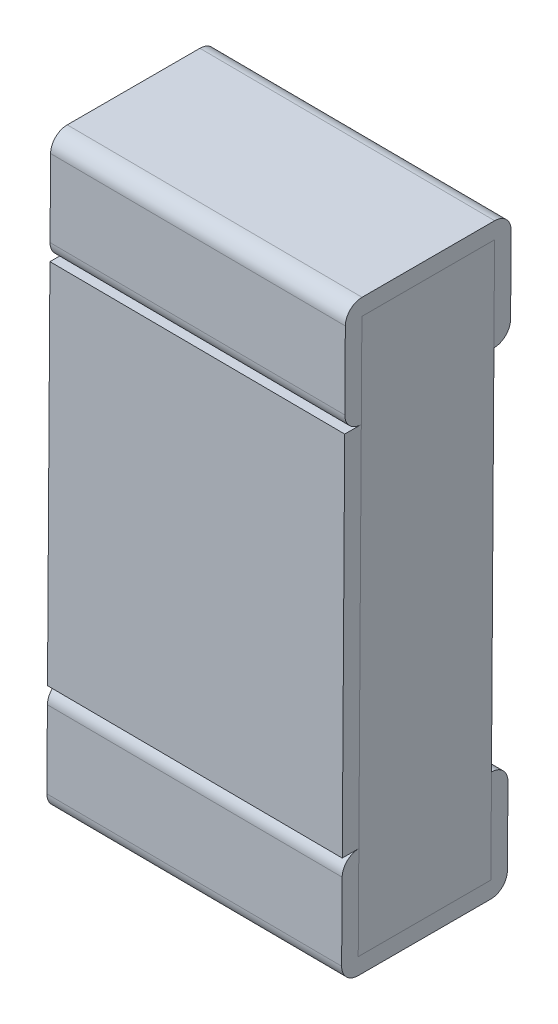
ISO-10303-21;
HEADER;
FILE_DESCRIPTION(('STEP AP214'),'2;1');
FILE_NAME('part.step','',(''),(''),'','','');
FILE_SCHEMA(('AUTOMOTIVE_DESIGN { 1 0 10303 214 1 1 1 1 }'));
ENDSEC;
DATA;
#1=APPLICATION_CONTEXT('core data for automotive mechanical design processes');
#2=APPLICATION_PROTOCOL_DEFINITION('international standard','automotive_design',2000,#1);
#3=PRODUCT_CONTEXT('',#1,'mechanical');
#4=PRODUCT('Part','Part','',(#3));
#5=PRODUCT_RELATED_PRODUCT_CATEGORY('part','',(#4));
#6=PRODUCT_DEFINITION_FORMATION('','',#4);
#7=PRODUCT_DEFINITION_CONTEXT('part definition',#1,'design');
#8=PRODUCT_DEFINITION('design','',#6,#7);
#9=PRODUCT_DEFINITION_SHAPE('','',#8);
#10=(LENGTH_UNIT() NAMED_UNIT(*) SI_UNIT(.MILLI.,.METRE.));
#11=(NAMED_UNIT(*) PLANE_ANGLE_UNIT() SI_UNIT($,.RADIAN.));
#12=(NAMED_UNIT(*) SI_UNIT($,.STERADIAN.) SOLID_ANGLE_UNIT());
#13=UNCERTAINTY_MEASURE_WITH_UNIT(LENGTH_MEASURE(1.E-05),#10,'distance_accuracy_value','');
#14=(GEOMETRIC_REPRESENTATION_CONTEXT(3) GLOBAL_UNCERTAINTY_ASSIGNED_CONTEXT((#13)) GLOBAL_UNIT_ASSIGNED_CONTEXT((#10,
#11,#12)) REPRESENTATION_CONTEXT('',''));
#15=CARTESIAN_POINT('',(0.,0.,0.));
#16=DIRECTION('',(0.,0.,1.));
#17=DIRECTION('',(1.,0.,0.));
#18=AXIS2_PLACEMENT_3D('',#15,#16,#17);
#19=CARTESIAN_POINT('',(191.579140246247,106.580336105174,142.661582908599));
#20=DIRECTION('',(0.,0.,1.));
#21=DIRECTION('',(1.,0.,0.));
#22=AXIS2_PLACEMENT_3D('',#19,#20,#21);
#23=PLANE('',#22);
#24=DIRECTION('',(0.999978016708569,-0.00663069374923689,0.));
#25=VECTOR('',#24,1.);
#26=CARTESIAN_POINT('',(191.579140246247,106.580336105174,142.661582908599));
#27=LINE('',#26,#25);
#28=CARTESIAN_POINT('',(191.579140246247,106.580336105174,142.661582908599));
#29=VERTEX_POINT('',#28);
#30=CARTESIAN_POINT('',(192.379122659614,106.575031550174,142.661582908599));
#31=VERTEX_POINT('',#30);
#32=EDGE_CURVE('E67',#29,#31,#27,.T.);
#33=ORIENTED_EDGE('',*,*,#32,.F.);
#34=DIRECTION('',(-0.00663069374923689,-0.999978016708569,0.));
#35=VECTOR('',#34,1.);
#36=CARTESIAN_POINT('',(191.579140246247,106.580336105174,142.661582908599));
#37=LINE('',#36,#35);
#38=CARTESIAN_POINT('',(191.572509552498,105.580358088465,142.661582908599));
#39=VERTEX_POINT('',#38);
#40=EDGE_CURVE('E11',#29,#39,#37,.T.);
#41=ORIENTED_EDGE('',*,*,#40,.T.);
#42=DIRECTION('',(0.999978016708569,-0.00663069374923689,0.));
#43=VECTOR('',#42,1.);
#44=CARTESIAN_POINT('',(191.572509552498,105.580358088465,142.661582908599));
#45=LINE('',#44,#43);
#46=CARTESIAN_POINT('',(192.372491965864,105.575053533466,142.661582908599));
#47=VERTEX_POINT('',#46);
#48=EDGE_CURVE('E55',#39,#47,#45,.T.);
#49=ORIENTED_EDGE('',*,*,#48,.T.);
#50=DIRECTION('',(-0.00663069374923689,-0.999978016708569,0.));
#51=VECTOR('',#50,1.);
#52=CARTESIAN_POINT('',(192.379122659614,106.575031550174,142.661582908599));
#53=LINE('',#52,#51);
#54=EDGE_CURVE('E188',#31,#47,#53,.T.);
#55=ORIENTED_EDGE('',*,*,#54,.F.);
#56=EDGE_LOOP('',(#33,#41,#49,#55));
#57=FACE_BOUND('',#56,.T.);
#58=ADVANCED_FACE('F44',(#57),#23,.T.);
#59=CARTESIAN_POINT('',(191.572509552498,105.580358088465,142.616582908599));
#60=DIRECTION('',(-0.00663069374923689,-0.99997801670857,0.));
#61=DIRECTION('',(-0.99997801670857,0.00663069374923689,0.));
#62=AXIS2_PLACEMENT_3D('',#59,#60,#61);
#63=PLANE('',#62);
#64=DIRECTION('',(0.,0.,1.));
#65=VECTOR('',#64,1.);
#66=CARTESIAN_POINT('',(191.572509552498,105.580358088465,142.616582908599));
#67=LINE('',#66,#65);
#68=CARTESIAN_POINT('',(191.572509552498,105.580358088465,142.616582908599));
#69=VERTEX_POINT('',#68);
#70=EDGE_CURVE('E834',#69,#39,#67,.T.);
#71=ORIENTED_EDGE('',*,*,#70,.F.);
#72=DIRECTION('',(0.999978016708569,-0.00663069374923689,0.));
#73=VECTOR('',#72,1.);
#74=CARTESIAN_POINT('',(191.572509552498,105.580358088465,142.616582908599));
#75=LINE('',#74,#73);
#76=CARTESIAN_POINT('',(192.372491965864,105.575053533466,142.616582908599));
#77=VERTEX_POINT('',#76);
#78=EDGE_CURVE('E204',#69,#77,#75,.T.);
#79=ORIENTED_EDGE('',*,*,#78,.T.);
#80=DIRECTION('',(0.,0.,1.));
#81=VECTOR('',#80,1.);
#82=CARTESIAN_POINT('',(192.372491965864,105.575053533466,142.616582908599));
#83=LINE('',#82,#81);
#84=EDGE_CURVE('E193',#77,#47,#83,.T.);
#85=ORIENTED_EDGE('',*,*,#84,.T.);
#86=ORIENTED_EDGE('',*,*,#48,.F.);
#87=EDGE_LOOP('',(#71,#79,#85,#86));
#88=FACE_BOUND('',#87,.T.);
#89=ADVANCED_FACE('F206',(#88),#63,.T.);
#90=CARTESIAN_POINT('',(191.572211171279,105.535359077713,142.616582908599));
#91=DIRECTION('',(0.999978016708571,-0.00663069374900344,0.));
#92=DIRECTION('',(0.00663069374900344,0.999978016708571,0.));
#93=AXIS2_PLACEMENT_3D('',#90,#91,#92);
#94=CYLINDRICAL_SURFACE('',#93,0.0450000000000037);
#95=CARTESIAN_POINT('',(191.572211171279,105.535359077713,142.616582908599));
#96=DIRECTION('',(0.99997801670857,-0.00663069374923689,0.));
#97=DIRECTION('',(0.,0.,1.));
#98=AXIS2_PLACEMENT_3D('',#95,#96,#97);
#99=CIRCLE('',#98,0.0449999999999895);
#100=CARTESIAN_POINT('',(191.572211171279,105.535359077713,142.661582908599));
#101=VERTEX_POINT('',#100);
#102=EDGE_CURVE('E210',#69,#101,#99,.T.);
#103=ORIENTED_EDGE('',*,*,#102,.T.);
#104=DIRECTION('',(0.999978016708569,-0.00663069374923689,0.));
#105=VECTOR('',#104,1.);
#106=CARTESIAN_POINT('',(191.572211171279,105.535359077713,142.661582908599));
#107=LINE('',#106,#105);
#108=CARTESIAN_POINT('',(192.372193584646,105.530054522714,142.661582908599));
#109=VERTEX_POINT('',#108);
#110=EDGE_CURVE('E219',#101,#109,#107,.T.);
#111=ORIENTED_EDGE('',*,*,#110,.T.);
#112=CARTESIAN_POINT('',(192.372193584646,105.530054522714,142.616582908599));
#113=DIRECTION('',(0.99997801670857,-0.00663069374923689,0.));
#114=DIRECTION('',(0.,0.,1.));
#115=AXIS2_PLACEMENT_3D('',#112,#113,#114);
#116=CIRCLE('',#115,0.0449999999999895);
#117=EDGE_CURVE('E332',#77,#109,#116,.T.);
#118=ORIENTED_EDGE('',*,*,#117,.F.);
#119=ORIENTED_EDGE('',*,*,#78,.F.);
#120=EDGE_LOOP('',(#103,#111,#118,#119));
#121=FACE_BOUND('',#120,.T.);
#122=ADVANCED_FACE('F398',(#121),#94,.T.);
#123=CARTESIAN_POINT('',(191.572509552498,105.580358088465,142.661582908599));
#124=DIRECTION('',(0.,0.,1.));
#125=DIRECTION('',(1.,0.,0.));
#126=AXIS2_PLACEMENT_3D('',#123,#124,#125);
#127=PLANE('',#126);
#128=DIRECTION('',(-0.00663069374923689,-0.999978016708569,0.));
#129=VECTOR('',#128,1.);
#130=CARTESIAN_POINT('',(192.372491965864,105.575053533466,142.661582908599));
#131=LINE('',#130,#129);
#132=CARTESIAN_POINT('',(192.370801138958,105.320059139205,142.661582908599));
#133=VERTEX_POINT('',#132);
#134=EDGE_CURVE('E249',#109,#133,#131,.T.);
#135=ORIENTED_EDGE('',*,*,#134,.F.);
#136=ORIENTED_EDGE('',*,*,#110,.F.);
#137=DIRECTION('',(-0.00663069374923689,-0.999978016708569,0.));
#138=VECTOR('',#137,1.);
#139=CARTESIAN_POINT('',(191.572509552498,105.580358088465,142.661582908599));
#140=LINE('',#139,#138);
#141=CARTESIAN_POINT('',(191.570818725591,105.325363694204,142.661582908599));
#142=VERTEX_POINT('',#141);
#143=EDGE_CURVE('E232',#101,#142,#140,.T.);
#144=ORIENTED_EDGE('',*,*,#143,.T.);
#145=DIRECTION('',(0.999978016708569,-0.00663069374923689,0.));
#146=VECTOR('',#145,1.);
#147=CARTESIAN_POINT('',(191.570818725591,105.325363694204,142.661582908599));
#148=LINE('',#147,#146);
#149=EDGE_CURVE('E284',#142,#133,#148,.T.);
#150=ORIENTED_EDGE('',*,*,#149,.T.);
#151=EDGE_LOOP('',(#135,#136,#144,#150));
#152=FACE_BOUND('',#151,.T.);
#153=ADVANCED_FACE('F402',(#152),#127,.T.);
#154=CARTESIAN_POINT('',(191.570818725591,105.325363694204,142.616582908599));
#155=DIRECTION('',(0.999978016708571,-0.00663069374900344,0.));
#156=DIRECTION('',(-0.00663069374900344,-0.999978016708571,0.));
#157=AXIS2_PLACEMENT_3D('',#154,#155,#156);
#158=CYLINDRICAL_SURFACE('',#157,0.0450000000000037);
#159=DIRECTION('',(0.999978016708569,-0.00663069374923689,0.));
#160=VECTOR('',#159,1.);
#161=CARTESIAN_POINT('',(191.570520344372,105.280364683453,142.616582908599));
#162=LINE('',#161,#160);
#163=CARTESIAN_POINT('',(191.570520344372,105.280364683453,142.616582908599));
#164=VERTEX_POINT('',#163);
#165=CARTESIAN_POINT('',(192.37050275774,105.275060128453,142.616582908599));
#166=VERTEX_POINT('',#165);
#167=EDGE_CURVE('E288',#164,#166,#162,.T.);
#168=ORIENTED_EDGE('',*,*,#167,.T.);
#169=CARTESIAN_POINT('',(192.370801138958,105.320059139205,142.616582908599));
#170=DIRECTION('',(-0.99997801670857,0.00663069374923689,0.));
#171=DIRECTION('',(0.,0.,1.));
#172=AXIS2_PLACEMENT_3D('',#169,#170,#171);
#173=CIRCLE('',#172,0.0449999999999895);
#174=EDGE_CURVE('E730',#166,#133,#173,.T.);
#175=ORIENTED_EDGE('',*,*,#174,.T.);
#176=ORIENTED_EDGE('',*,*,#149,.F.);
#177=CARTESIAN_POINT('',(191.570818725591,105.325363694204,142.616582908599));
#178=DIRECTION('',(-0.99997801670857,0.00663069374923689,0.));
#179=DIRECTION('',(0.,0.,1.));
#180=AXIS2_PLACEMENT_3D('',#177,#178,#179);
#181=CIRCLE('',#180,0.0449999999999895);
#182=EDGE_CURVE('E238',#164,#142,#181,.T.);
#183=ORIENTED_EDGE('',*,*,#182,.F.);
#184=EDGE_LOOP('',(#168,#175,#176,#183));
#185=FACE_BOUND('',#184,.T.);
#186=ADVANCED_FACE('F440',(#185),#158,.T.);
#187=CARTESIAN_POINT('',(191.570520344372,105.280364683453,142.211582908599));
#188=DIRECTION('',(-0.00663069374923689,-0.99997801670857,0.));
#189=DIRECTION('',(-0.99997801670857,0.00663069374923689,0.));
#190=AXIS2_PLACEMENT_3D('',#187,#188,#189);
#191=PLANE('',#190);
#192=DIRECTION('',(0.,0.,1.));
#193=VECTOR('',#192,1.);
#194=CARTESIAN_POINT('',(191.570520344372,105.280364683453,142.211582908599));
#195=LINE('',#194,#193);
#196=CARTESIAN_POINT('',(191.570520344372,105.280364683453,142.256582908599));
#197=VERTEX_POINT('',#196);
#198=EDGE_CURVE('E233',#197,#164,#195,.T.);
#199=ORIENTED_EDGE('',*,*,#198,.F.);
#200=DIRECTION('',(0.999978016708569,-0.00663069374923689,0.));
#201=VECTOR('',#200,1.);
#202=CARTESIAN_POINT('',(191.570520344372,105.280364683453,142.256582908599));
#203=LINE('',#202,#201);
#204=CARTESIAN_POINT('',(192.37050275774,105.275060128453,142.256582908599));
#205=VERTEX_POINT('',#204);
#206=EDGE_CURVE('E299',#197,#205,#203,.T.);
#207=ORIENTED_EDGE('',*,*,#206,.T.);
#208=DIRECTION('',(0.,0.,1.));
#209=VECTOR('',#208,1.);
#210=CARTESIAN_POINT('',(192.37050275774,105.275060128453,142.211582908599));
#211=LINE('',#210,#209);
#212=EDGE_CURVE('E295',#205,#166,#211,.T.);
#213=ORIENTED_EDGE('',*,*,#212,.T.);
#214=ORIENTED_EDGE('',*,*,#167,.F.);
#215=EDGE_LOOP('',(#199,#207,#213,#214));
#216=FACE_BOUND('',#215,.T.);
#217=ADVANCED_FACE('F564',(#216),#191,.T.);
#218=CARTESIAN_POINT('',(191.570818725591,105.325363694204,142.256582908599));
#219=DIRECTION('',(0.999978016708571,-0.00663069374900344,0.));
#220=DIRECTION('',(-0.00663069374900344,-0.999978016708571,0.));
#221=AXIS2_PLACEMENT_3D('',#218,#219,#220);
#222=CYLINDRICAL_SURFACE('',#221,0.0450000000000037);
#223=CARTESIAN_POINT('',(191.570818725591,105.325363694204,142.256582908599));
#224=DIRECTION('',(0.99997801670857,-0.00663069374923689,0.));
#225=DIRECTION('',(0.,0.,1.));
#226=AXIS2_PLACEMENT_3D('',#223,#224,#225);
#227=CIRCLE('',#226,0.0449999999999895);
#228=CARTESIAN_POINT('',(191.570818725591,105.325363694204,142.211582908599));
#229=VERTEX_POINT('',#228);
#230=EDGE_CURVE('E282',#197,#229,#227,.T.);
#231=ORIENTED_EDGE('',*,*,#230,.T.);
#232=DIRECTION('',(0.999978016708569,-0.00663069374923689,0.));
#233=VECTOR('',#232,1.);
#234=CARTESIAN_POINT('',(191.570818725591,105.325363694204,142.211582908599));
#235=LINE('',#234,#233);
#236=CARTESIAN_POINT('',(192.370801138958,105.320059139205,142.211582908599));
#237=VERTEX_POINT('',#236);
#238=EDGE_CURVE('E279',#229,#237,#235,.T.);
#239=ORIENTED_EDGE('',*,*,#238,.T.);
#240=CARTESIAN_POINT('',(192.370801138958,105.320059139205,142.256582908599));
#241=DIRECTION('',(0.99997801670857,-0.00663069374923689,0.));
#242=DIRECTION('',(0.,0.,1.));
#243=AXIS2_PLACEMENT_3D('',#240,#241,#242);
#244=CIRCLE('',#243,0.0449999999999895);
#245=EDGE_CURVE('E245',#205,#237,#244,.T.);
#246=ORIENTED_EDGE('',*,*,#245,.F.);
#247=ORIENTED_EDGE('',*,*,#206,.F.);
#248=EDGE_LOOP('',(#231,#239,#246,#247));
#249=FACE_BOUND('',#248,.T.);
#250=ADVANCED_FACE('F485',(#249),#222,.T.);
#251=CARTESIAN_POINT('',(191.572509552498,105.580358088465,142.211582908599));
#252=DIRECTION('',(0.,0.,1.));
#253=DIRECTION('',(1.,0.,0.));
#254=AXIS2_PLACEMENT_3D('',#251,#252,#253);
#255=PLANE('',#254);
#256=ORIENTED_EDGE('',*,*,#238,.F.);
#257=DIRECTION('',(-0.00663069374923689,-0.999978016708569,0.));
#258=VECTOR('',#257,1.);
#259=CARTESIAN_POINT('',(191.572509552498,105.580358088465,142.211582908599));
#260=LINE('',#259,#258);
#261=CARTESIAN_POINT('',(191.572211171279,105.535359077713,142.211582908599));
#262=VERTEX_POINT('',#261);
#263=EDGE_CURVE('E320',#262,#229,#260,.T.);
#264=ORIENTED_EDGE('',*,*,#263,.F.);
#265=DIRECTION('',(0.999978016708569,-0.00663069374923689,0.));
#266=VECTOR('',#265,1.);
#267=CARTESIAN_POINT('',(191.572211171279,105.535359077713,142.211582908599));
#268=LINE('',#267,#266);
#269=CARTESIAN_POINT('',(192.372193584646,105.530054522714,142.211582908599));
#270=VERTEX_POINT('',#269);
#271=EDGE_CURVE('E268',#262,#270,#268,.T.);
#272=ORIENTED_EDGE('',*,*,#271,.T.);
#273=DIRECTION('',(-0.00663069374923689,-0.999978016708569,0.));
#274=VECTOR('',#273,1.);
#275=CARTESIAN_POINT('',(192.372491965864,105.575053533466,142.211582908599));
#276=LINE('',#275,#274);
#277=EDGE_CURVE('E264',#270,#237,#276,.T.);
#278=ORIENTED_EDGE('',*,*,#277,.T.);
#279=EDGE_LOOP('',(#256,#264,#272,#278));
#280=FACE_BOUND('',#279,.T.);
#281=ADVANCED_FACE('F362',(#280),#255,.F.);
#282=CARTESIAN_POINT('',(191.572211171279,105.535359077713,142.256582908599));
#283=DIRECTION('',(0.999978016708571,-0.00663069374900344,0.));
#284=DIRECTION('',(0.00663069374900344,0.999978016708571,0.));
#285=AXIS2_PLACEMENT_3D('',#282,#283,#284);
#286=CYLINDRICAL_SURFACE('',#285,0.0450000000000037);
#287=DIRECTION('',(0.999978016708569,-0.00663069374923689,0.));
#288=VECTOR('',#287,1.);
#289=CARTESIAN_POINT('',(191.572509552498,105.580358088465,142.256582908599));
#290=LINE('',#289,#288);
#291=CARTESIAN_POINT('',(191.572509552498,105.580358088465,142.256582908599));
#292=VERTEX_POINT('',#291);
#293=CARTESIAN_POINT('',(192.372491965864,105.575053533466,142.256582908599));
#294=VERTEX_POINT('',#293);
#295=EDGE_CURVE('E258',#292,#294,#290,.T.);
#296=ORIENTED_EDGE('',*,*,#295,.T.);
#297=CARTESIAN_POINT('',(192.372193584646,105.530054522714,142.256582908599));
#298=DIRECTION('',(-0.99997801670857,0.00663069374923689,0.));
#299=DIRECTION('',(0.,0.,1.));
#300=AXIS2_PLACEMENT_3D('',#297,#298,#299);
#301=CIRCLE('',#300,0.0449999999999895);
#302=EDGE_CURVE('E254',#294,#270,#301,.T.);
#303=ORIENTED_EDGE('',*,*,#302,.T.);
#304=ORIENTED_EDGE('',*,*,#271,.F.);
#305=CARTESIAN_POINT('',(191.572211171279,105.535359077713,142.256582908599));
#306=DIRECTION('',(-0.99997801670857,0.00663069374923689,0.));
#307=DIRECTION('',(0.,0.,1.));
#308=AXIS2_PLACEMENT_3D('',#305,#306,#307);
#309=CIRCLE('',#308,0.0449999999999895);
#310=EDGE_CURVE('E315',#292,#262,#309,.T.);
#311=ORIENTED_EDGE('',*,*,#310,.F.);
#312=EDGE_LOOP('',(#296,#303,#304,#311));
#313=FACE_BOUND('',#312,.T.);
#314=ADVANCED_FACE('F356',(#313),#286,.T.);
#315=CARTESIAN_POINT('',(192.379122659614,106.575031550174,142.616582908599));
#316=DIRECTION('',(0.99997801670857,-0.00663069374923689,0.));
#317=DIRECTION('',(0.,0.,-1.));
#318=AXIS2_PLACEMENT_3D('',#315,#316,#317);
#319=PLANE('',#318);
#320=DIRECTION('',(-0.00663069374923689,-0.999978016708569,0.));
#321=VECTOR('',#320,1.);
#322=CARTESIAN_POINT('',(192.379122659614,106.575031550174,142.616582908599));
#323=LINE('',#322,#321);
#324=CARTESIAN_POINT('',(192.379122659614,106.575031550174,142.616582908599));
#325=VERTEX_POINT('',#324);
#326=EDGE_CURVE('E308',#325,#77,#323,.T.);
#327=ORIENTED_EDGE('',*,*,#326,.F.);
#328=DIRECTION('',(0.,0.,1.));
#329=VECTOR('',#328,1.);
#330=CARTESIAN_POINT('',(192.379122659614,106.575031550174,142.616582908599));
#331=LINE('',#330,#329);
#332=EDGE_CURVE('E196',#325,#31,#331,.T.);
#333=ORIENTED_EDGE('',*,*,#332,.T.);
#334=ORIENTED_EDGE('',*,*,#54,.T.);
#335=ORIENTED_EDGE('',*,*,#84,.F.);
#336=EDGE_LOOP('',(#327,#333,#334,#335));
#337=FACE_BOUND('',#336,.T.);
#338=ADVANCED_FACE('F191',(#337),#319,.T.);
#339=CARTESIAN_POINT('',(192.372491965864,105.575053533466,142.211582908599));
#340=DIRECTION('',(0.99997801670857,-0.00663069374923689,0.));
#341=DIRECTION('',(0.,0.,-1.));
#342=AXIS2_PLACEMENT_3D('',#339,#340,#341);
#343=PLANE('',#342);
#344=ORIENTED_EDGE('',*,*,#277,.F.);
#345=ORIENTED_EDGE('',*,*,#302,.F.);
#346=DIRECTION('',(-0.00663069374923689,-0.999978016708569,0.));
#347=VECTOR('',#346,1.);
#348=CARTESIAN_POINT('',(192.38081348652,106.830025944435,142.256582908599));
#349=LINE('',#348,#347);
#350=CARTESIAN_POINT('',(192.370801138958,105.320059139205,142.256582908599));
#351=VERTEX_POINT('',#350);
#352=EDGE_CURVE('E198',#294,#351,#349,.T.);
#353=ORIENTED_EDGE('',*,*,#352,.T.);
#354=DIRECTION('',(0.,0.,1.));
#355=VECTOR('',#354,1.);
#356=CARTESIAN_POINT('',(192.370801138958,105.320059139205,142.256582908599));
#357=LINE('',#356,#355);
#358=CARTESIAN_POINT('',(192.370801138958,105.320059139205,142.616582908599));
#359=VERTEX_POINT('',#358);
#360=EDGE_CURVE('E335',#351,#359,#357,.T.);
#361=ORIENTED_EDGE('',*,*,#360,.T.);
#362=DIRECTION('',(-0.00663069374923689,-0.999978016708569,0.));
#363=VECTOR('',#362,1.);
#364=CARTESIAN_POINT('',(192.38081348652,106.830025944435,142.616582908599));
#365=LINE('',#364,#363);
#366=EDGE_CURVE('E331',#77,#359,#365,.T.);
#367=ORIENTED_EDGE('',*,*,#366,.F.);
#368=ORIENTED_EDGE('',*,*,#117,.T.);
#369=ORIENTED_EDGE('',*,*,#134,.T.);
#370=ORIENTED_EDGE('',*,*,#174,.F.);
#371=ORIENTED_EDGE('',*,*,#212,.F.);
#372=ORIENTED_EDGE('',*,*,#245,.T.);
#373=EDGE_LOOP('',(#344,#345,#353,#361,#367,#368,#369,#370,#371,#372));
#374=FACE_BOUND('',#373,.T.);
#375=ADVANCED_FACE('F385',(#374),#343,.T.);
#376=CARTESIAN_POINT('',(191.579140246247,106.580336105174,142.616582908599));
#377=DIRECTION('',(-0.00663069374923689,-0.99997801670857,0.));
#378=DIRECTION('',(-0.99997801670857,0.00663069374923689,0.));
#379=AXIS2_PLACEMENT_3D('',#376,#377,#378);
#380=PLANE('',#379);
#381=ORIENTED_EDGE('',*,*,#32,.T.);
#382=ORIENTED_EDGE('',*,*,#332,.F.);
#383=DIRECTION('',(0.999978016708569,-0.00663069374923689,0.));
#384=VECTOR('',#383,1.);
#385=CARTESIAN_POINT('',(191.579140246247,106.580336105174,142.616582908599));
#386=LINE('',#385,#384);
#387=CARTESIAN_POINT('',(191.579140246247,106.580336105174,142.616582908599));
#388=VERTEX_POINT('',#387);
#389=EDGE_CURVE('E313',#388,#325,#386,.T.);
#390=ORIENTED_EDGE('',*,*,#389,.F.);
#391=DIRECTION('',(0.,0.,1.));
#392=VECTOR('',#391,1.);
#393=CARTESIAN_POINT('',(191.579140246247,106.580336105174,142.616582908599));
#394=LINE('',#393,#392);
#395=EDGE_CURVE('E322',#388,#29,#394,.T.);
#396=ORIENTED_EDGE('',*,*,#395,.T.);
#397=EDGE_LOOP('',(#381,#382,#390,#396));
#398=FACE_BOUND('',#397,.T.);
#399=ADVANCED_FACE('F389',(#398),#380,.F.);
#400=CARTESIAN_POINT('',(191.579140246247,106.580336105174,142.616582908599));
#401=DIRECTION('',(0.99997801670857,-0.00663069374923689,0.));
#402=DIRECTION('',(0.,0.,-1.));
#403=AXIS2_PLACEMENT_3D('',#400,#401,#402);
#404=PLANE('',#403);
#405=ORIENTED_EDGE('',*,*,#70,.T.);
#406=ORIENTED_EDGE('',*,*,#40,.F.);
#407=ORIENTED_EDGE('',*,*,#395,.F.);
#408=DIRECTION('',(-0.00663069374923689,-0.999978016708569,0.));
#409=VECTOR('',#408,1.);
#410=CARTESIAN_POINT('',(191.579140246247,106.580336105174,142.616582908599));
#411=LINE('',#410,#409);
#412=EDGE_CURVE('E237',#388,#69,#411,.T.);
#413=ORIENTED_EDGE('',*,*,#412,.T.);
#414=EDGE_LOOP('',(#405,#406,#407,#413));
#415=FACE_BOUND('',#414,.T.);
#416=ADVANCED_FACE('F425',(#415),#404,.F.);
#417=CARTESIAN_POINT('',(191.572509552498,105.580358088465,142.211582908599));
#418=DIRECTION('',(0.99997801670857,-0.00663069374923689,0.));
#419=DIRECTION('',(0.,0.,-1.));
#420=AXIS2_PLACEMENT_3D('',#417,#418,#419);
#421=PLANE('',#420);
#422=ORIENTED_EDGE('',*,*,#230,.F.);
#423=ORIENTED_EDGE('',*,*,#198,.T.);
#424=ORIENTED_EDGE('',*,*,#182,.T.);
#425=ORIENTED_EDGE('',*,*,#143,.F.);
#426=ORIENTED_EDGE('',*,*,#102,.F.);
#427=DIRECTION('',(-0.00663069374923689,-0.999978016708569,0.));
#428=VECTOR('',#427,1.);
#429=CARTESIAN_POINT('',(191.580831073153,106.835330499434,142.616582908599));
#430=LINE('',#429,#428);
#431=CARTESIAN_POINT('',(191.570818725591,105.325363694204,142.616582908599));
#432=VERTEX_POINT('',#431);
#433=EDGE_CURVE('E319',#69,#432,#430,.T.);
#434=ORIENTED_EDGE('',*,*,#433,.T.);
#435=DIRECTION('',(0.,0.,1.));
#436=VECTOR('',#435,1.);
#437=CARTESIAN_POINT('',(191.570818725591,105.325363694204,142.256582908599));
#438=LINE('',#437,#436);
#439=CARTESIAN_POINT('',(191.570818725591,105.325363694204,142.256582908599));
#440=VERTEX_POINT('',#439);
#441=EDGE_CURVE('E225',#440,#432,#438,.T.);
#442=ORIENTED_EDGE('',*,*,#441,.F.);
#443=DIRECTION('',(-0.00663069374923689,-0.999978016708569,0.));
#444=VECTOR('',#443,1.);
#445=CARTESIAN_POINT('',(191.580831073153,106.835330499434,142.256582908599));
#446=LINE('',#445,#444);
#447=EDGE_CURVE('E48',#292,#440,#446,.T.);
#448=ORIENTED_EDGE('',*,*,#447,.F.);
#449=ORIENTED_EDGE('',*,*,#310,.T.);
#450=ORIENTED_EDGE('',*,*,#263,.T.);
#451=EDGE_LOOP('',(#422,#423,#424,#425,#426,#434,#442,#448,#449,#450));
#452=FACE_BOUND('',#451,.T.);
#453=ADVANCED_FACE('F46',(#452),#421,.F.);
#454=CARTESIAN_POINT('',(191.580831073153,106.835330499434,142.256582908599));
#455=DIRECTION('',(0.,0.,1.));
#456=DIRECTION('',(1.,0.,0.));
#457=AXIS2_PLACEMENT_3D('',#454,#455,#456);
#458=PLANE('',#457);
#459=DIRECTION('',(-0.00663069374923689,-0.999978016708569,0.));
#460=VECTOR('',#459,1.);
#461=CARTESIAN_POINT('',(192.38081348652,106.830025944435,142.256582908599));
#462=LINE('',#461,#460);
#463=CARTESIAN_POINT('',(192.379122659614,106.575031550174,142.256582908599));
#464=VERTEX_POINT('',#463);
#465=EDGE_CURVE('E223',#464,#294,#462,.T.);
#466=ORIENTED_EDGE('',*,*,#465,.T.);
#467=ORIENTED_EDGE('',*,*,#295,.F.);
#468=DIRECTION('',(-0.00663069374923689,-0.999978016708569,0.));
#469=VECTOR('',#468,1.);
#470=CARTESIAN_POINT('',(191.580831073153,106.835330499434,142.256582908599));
#471=LINE('',#470,#469);
#472=CARTESIAN_POINT('',(191.579140246247,106.580336105174,142.256582908599));
#473=VERTEX_POINT('',#472);
#474=EDGE_CURVE('E355',#473,#292,#471,.T.);
#475=ORIENTED_EDGE('',*,*,#474,.F.);
#476=DIRECTION('',(0.999978016708569,-0.00663069374923689,0.));
#477=VECTOR('',#476,1.);
#478=CARTESIAN_POINT('',(191.579140246247,106.580336105174,142.256582908599));
#479=LINE('',#478,#477);
#480=EDGE_CURVE('E269',#473,#464,#479,.T.);
#481=ORIENTED_EDGE('',*,*,#480,.T.);
#482=EDGE_LOOP('',(#466,#467,#475,#481));
#483=FACE_BOUND('',#482,.T.);
#484=ADVANCED_FACE('F499',(#483),#458,.F.);
#485=CARTESIAN_POINT('',(192.38081348652,106.830025944435,142.256582908599));
#486=DIRECTION('',(0.99997801670857,-0.00663069374923689,0.));
#487=DIRECTION('',(0.,0.,-1.));
#488=AXIS2_PLACEMENT_3D('',#485,#486,#487);
#489=PLANE('',#488);
#490=DIRECTION('',(-0.00663069374923689,-0.999978016708569,0.));
#491=VECTOR('',#490,1.);
#492=CARTESIAN_POINT('',(192.38081348652,106.830025944435,142.256582908599));
#493=LINE('',#492,#491);
#494=CARTESIAN_POINT('',(192.38081348652,106.830025944435,142.256582908599));
#495=VERTEX_POINT('',#494);
#496=EDGE_CURVE('E345',#495,#464,#493,.T.);
#497=ORIENTED_EDGE('',*,*,#496,.F.);
#498=DIRECTION('',(0.,0.,1.));
#499=VECTOR('',#498,1.);
#500=CARTESIAN_POINT('',(192.38081348652,106.830025944435,142.256582908599));
#501=LINE('',#500,#499);
#502=CARTESIAN_POINT('',(192.38081348652,106.830025944435,142.616582908599));
#503=VERTEX_POINT('',#502);
#504=EDGE_CURVE('E273',#495,#503,#501,.T.);
#505=ORIENTED_EDGE('',*,*,#504,.T.);
#506=DIRECTION('',(-0.00663069374923689,-0.999978016708569,0.));
#507=VECTOR('',#506,1.);
#508=CARTESIAN_POINT('',(192.38081348652,106.830025944435,142.616582908599));
#509=LINE('',#508,#507);
#510=EDGE_CURVE('E304',#503,#325,#509,.T.);
#511=ORIENTED_EDGE('',*,*,#510,.T.);
#512=ORIENTED_EDGE('',*,*,#326,.T.);
#513=ORIENTED_EDGE('',*,*,#366,.T.);
#514=ORIENTED_EDGE('',*,*,#360,.F.);
#515=ORIENTED_EDGE('',*,*,#352,.F.);
#516=ORIENTED_EDGE('',*,*,#465,.F.);
#517=EDGE_LOOP('',(#497,#505,#511,#512,#513,#514,#515,#516));
#518=FACE_BOUND('',#517,.T.);
#519=ADVANCED_FACE('F494',(#518),#489,.T.);
#520=CARTESIAN_POINT('',(191.579438627465,106.625335115926,142.616582908599));
#521=DIRECTION('',(0.999978016708571,-0.00663069374900344,0.));
#522=DIRECTION('',(-0.00663069374900344,-0.999978016708571,0.));
#523=AXIS2_PLACEMENT_3D('',#520,#521,#522);
#524=CYLINDRICAL_SURFACE('',#523,0.0450000000000037);
#525=ORIENTED_EDGE('',*,*,#389,.T.);
#526=CARTESIAN_POINT('',(192.379421040832,106.620030560926,142.616582908599));
#527=DIRECTION('',(-0.99997801670857,0.00663069374923689,0.));
#528=DIRECTION('',(0.,0.,1.));
#529=AXIS2_PLACEMENT_3D('',#526,#527,#528);
#530=CIRCLE('',#529,0.0449999999999895);
#531=CARTESIAN_POINT('',(192.379421040832,106.620030560926,142.661582908599));
#532=VERTEX_POINT('',#531);
#533=EDGE_CURVE('E309',#325,#532,#530,.T.);
#534=ORIENTED_EDGE('',*,*,#533,.T.);
#535=DIRECTION('',(0.999978016708569,-0.00663069374923689,0.));
#536=VECTOR('',#535,1.);
#537=CARTESIAN_POINT('',(191.579438627465,106.625335115926,142.661582908599));
#538=LINE('',#537,#536);
#539=CARTESIAN_POINT('',(191.579438627465,106.625335115926,142.661582908599));
#540=VERTEX_POINT('',#539);
#541=EDGE_CURVE('E754',#540,#532,#538,.T.);
#542=ORIENTED_EDGE('',*,*,#541,.F.);
#543=CARTESIAN_POINT('',(191.579438627465,106.625335115926,142.616582908599));
#544=DIRECTION('',(-0.99997801670857,0.00663069374923689,0.));
#545=DIRECTION('',(0.,0.,1.));
#546=AXIS2_PLACEMENT_3D('',#543,#544,#545);
#547=CIRCLE('',#546,0.0449999999999895);
#548=EDGE_CURVE('E239',#388,#540,#547,.T.);
#549=ORIENTED_EDGE('',*,*,#548,.F.);
#550=EDGE_LOOP('',(#525,#534,#542,#549));
#551=FACE_BOUND('',#550,.T.);
#552=ADVANCED_FACE('F498',(#551),#524,.T.);
#553=CARTESIAN_POINT('',(191.581129454372,106.880329510186,142.661582908599));
#554=DIRECTION('',(0.,0.,1.));
#555=DIRECTION('',(1.,0.,0.));
#556=AXIS2_PLACEMENT_3D('',#553,#554,#555);
#557=PLANE('',#556);
#558=DIRECTION('',(-0.00663069374923689,-0.999978016708569,0.));
#559=VECTOR('',#558,1.);
#560=CARTESIAN_POINT('',(192.381111867738,106.875024955187,142.661582908599));
#561=LINE('',#560,#559);
#562=CARTESIAN_POINT('',(192.38081348652,106.830025944435,142.661582908599));
#563=VERTEX_POINT('',#562);
#564=EDGE_CURVE('E294',#563,#532,#561,.T.);
#565=ORIENTED_EDGE('',*,*,#564,.F.);
#566=DIRECTION('',(0.999978016708569,-0.00663069374923689,0.));
#567=VECTOR('',#566,1.);
#568=CARTESIAN_POINT('',(191.580831073153,106.835330499434,142.661582908599));
#569=LINE('',#568,#567);
#570=CARTESIAN_POINT('',(191.580831073153,106.835330499434,142.661582908599));
#571=VERTEX_POINT('',#570);
#572=EDGE_CURVE('E259',#571,#563,#569,.T.);
#573=ORIENTED_EDGE('',*,*,#572,.F.);
#574=DIRECTION('',(-0.00663069374923689,-0.999978016708569,0.));
#575=VECTOR('',#574,1.);
#576=CARTESIAN_POINT('',(191.581129454372,106.880329510186,142.661582908599));
#577=LINE('',#576,#575);
#578=EDGE_CURVE('E314',#571,#540,#577,.T.);
#579=ORIENTED_EDGE('',*,*,#578,.T.);
#580=ORIENTED_EDGE('',*,*,#541,.T.);
#581=EDGE_LOOP('',(#565,#573,#579,#580));
#582=FACE_BOUND('',#581,.T.);
#583=ADVANCED_FACE('F522',(#582),#557,.T.);
#584=CARTESIAN_POINT('',(191.580831073153,106.835330499434,142.256582908599));
#585=DIRECTION('',(0.99997801670857,-0.00663069374923689,0.));
#586=DIRECTION('',(0.,0.,-1.));
#587=AXIS2_PLACEMENT_3D('',#584,#585,#586);
#588=PLANE('',#587);
#589=ORIENTED_EDGE('',*,*,#474,.T.);
#590=ORIENTED_EDGE('',*,*,#447,.T.);
#591=ORIENTED_EDGE('',*,*,#441,.T.);
#592=ORIENTED_EDGE('',*,*,#433,.F.);
#593=ORIENTED_EDGE('',*,*,#412,.F.);
#594=DIRECTION('',(-0.00663069374923689,-0.999978016708569,0.));
#595=VECTOR('',#594,1.);
#596=CARTESIAN_POINT('',(191.580831073153,106.835330499434,142.616582908599));
#597=LINE('',#596,#595);
#598=CARTESIAN_POINT('',(191.580831073153,106.835330499434,142.616582908599));
#599=VERTEX_POINT('',#598);
#600=EDGE_CURVE('E243',#599,#388,#597,.T.);
#601=ORIENTED_EDGE('',*,*,#600,.F.);
#602=DIRECTION('',(0.,0.,1.));
#603=VECTOR('',#602,1.);
#604=CARTESIAN_POINT('',(191.580831073153,106.835330499434,142.256582908599));
#605=LINE('',#604,#603);
#606=CARTESIAN_POINT('',(191.580831073153,106.835330499434,142.256582908599));
#607=VERTEX_POINT('',#606);
#608=EDGE_CURVE('E303',#607,#599,#605,.T.);
#609=ORIENTED_EDGE('',*,*,#608,.F.);
#610=DIRECTION('',(-0.00663069374923689,-0.999978016708569,0.));
#611=VECTOR('',#610,1.);
#612=CARTESIAN_POINT('',(191.580831073153,106.835330499434,142.256582908599));
#613=LINE('',#612,#611);
#614=EDGE_CURVE('E228',#607,#473,#613,.T.);
#615=ORIENTED_EDGE('',*,*,#614,.T.);
#616=EDGE_LOOP('',(#589,#590,#591,#592,#593,#601,#609,#615));
#617=FACE_BOUND('',#616,.T.);
#618=ADVANCED_FACE('F416',(#617),#588,.F.);
#619=CARTESIAN_POINT('',(191.579438627465,106.625335115926,142.256582908599));
#620=DIRECTION('',(0.999978016708571,-0.00663069374900344,0.));
#621=DIRECTION('',(-0.00663069374900344,-0.999978016708571,0.));
#622=AXIS2_PLACEMENT_3D('',#619,#620,#621);
#623=CYLINDRICAL_SURFACE('',#622,0.0450000000000037);
#624=CARTESIAN_POINT('',(191.579438627465,106.625335115926,142.256582908599));
#625=DIRECTION('',(0.99997801670857,-0.00663069374923689,0.));
#626=DIRECTION('',(0.,0.,1.));
#627=AXIS2_PLACEMENT_3D('',#624,#625,#626);
#628=CIRCLE('',#627,0.0449999999999895);
#629=CARTESIAN_POINT('',(191.579438627465,106.625335115926,142.211582908599));
#630=VERTEX_POINT('',#629);
#631=EDGE_CURVE('E744',#473,#630,#628,.T.);
#632=ORIENTED_EDGE('',*,*,#631,.T.);
#633=DIRECTION('',(0.999978016708569,-0.00663069374923689,0.));
#634=VECTOR('',#633,1.);
#635=CARTESIAN_POINT('',(191.579438627465,106.625335115926,142.211582908599));
#636=LINE('',#635,#634);
#637=CARTESIAN_POINT('',(192.379421040832,106.620030560926,142.211582908599));
#638=VERTEX_POINT('',#637);
#639=EDGE_CURVE('E750',#630,#638,#636,.T.);
#640=ORIENTED_EDGE('',*,*,#639,.T.);
#641=CARTESIAN_POINT('',(192.379421040832,106.620030560926,142.256582908599));
#642=DIRECTION('',(0.99997801670857,-0.00663069374923689,0.));
#643=DIRECTION('',(0.,0.,1.));
#644=AXIS2_PLACEMENT_3D('',#641,#642,#643);
#645=CIRCLE('',#644,0.0449999999999895);
#646=EDGE_CURVE('E760',#464,#638,#645,.T.);
#647=ORIENTED_EDGE('',*,*,#646,.F.);
#648=ORIENTED_EDGE('',*,*,#480,.F.);
#649=EDGE_LOOP('',(#632,#640,#647,#648));
#650=FACE_BOUND('',#649,.T.);
#651=ADVANCED_FACE('F411',(#650),#623,.T.);
#652=CARTESIAN_POINT('',(191.581129454372,106.880329510186,142.211582908599));
#653=DIRECTION('',(0.,0.,1.));
#654=DIRECTION('',(1.,0.,0.));
#655=AXIS2_PLACEMENT_3D('',#652,#653,#654);
#656=PLANE('',#655);
#657=ORIENTED_EDGE('',*,*,#639,.F.);
#658=DIRECTION('',(-0.00663069374923689,-0.999978016708569,0.));
#659=VECTOR('',#658,1.);
#660=CARTESIAN_POINT('',(191.581129454372,106.880329510186,142.211582908599));
#661=LINE('',#660,#659);
#662=CARTESIAN_POINT('',(191.580831073153,106.835330499434,142.211582908599));
#663=VERTEX_POINT('',#662);
#664=EDGE_CURVE('E253',#663,#630,#661,.T.);
#665=ORIENTED_EDGE('',*,*,#664,.F.);
#666=DIRECTION('',(0.999978016708569,-0.00663069374923689,0.));
#667=VECTOR('',#666,1.);
#668=CARTESIAN_POINT('',(191.580831073153,106.835330499434,142.211582908599));
#669=LINE('',#668,#667);
#670=CARTESIAN_POINT('',(192.38081348652,106.830025944435,142.211582908599));
#671=VERTEX_POINT('',#670);
#672=EDGE_CURVE('E793',#663,#671,#669,.T.);
#673=ORIENTED_EDGE('',*,*,#672,.T.);
#674=DIRECTION('',(-0.00663069374923689,-0.999978016708569,0.));
#675=VECTOR('',#674,1.);
#676=CARTESIAN_POINT('',(192.381111867738,106.875024955187,142.211582908599));
#677=LINE('',#676,#675);
#678=EDGE_CURVE('E779',#671,#638,#677,.T.);
#679=ORIENTED_EDGE('',*,*,#678,.T.);
#680=EDGE_LOOP('',(#657,#665,#673,#679));
#681=FACE_BOUND('',#680,.T.);
#682=ADVANCED_FACE('F415',(#681),#656,.F.);
#683=CARTESIAN_POINT('',(192.381111867738,106.875024955187,142.211582908599));
#684=DIRECTION('',(0.99997801670857,-0.00663069374923689,0.));
#685=DIRECTION('',(0.,0.,-1.));
#686=AXIS2_PLACEMENT_3D('',#683,#684,#685);
#687=PLANE('',#686);
#688=ORIENTED_EDGE('',*,*,#678,.F.);
#689=CARTESIAN_POINT('',(192.38081348652,106.830025944435,142.256582908599));
#690=DIRECTION('',(-0.99997801670857,0.00663069374923689,0.));
#691=DIRECTION('',(0.,0.,1.));
#692=AXIS2_PLACEMENT_3D('',#689,#690,#691);
#693=CIRCLE('',#692,0.0449999999999895);
#694=CARTESIAN_POINT('',(192.381111867738,106.875024955187,142.256582908599));
#695=VERTEX_POINT('',#694);
#696=EDGE_CURVE('E327',#695,#671,#693,.T.);
#697=ORIENTED_EDGE('',*,*,#696,.F.);
#698=DIRECTION('',(0.,0.,1.));
#699=VECTOR('',#698,1.);
#700=CARTESIAN_POINT('',(192.381111867738,106.875024955187,142.211582908599));
#701=LINE('',#700,#699);
#702=CARTESIAN_POINT('',(192.381111867738,106.875024955187,142.616582908599));
#703=VERTEX_POINT('',#702);
#704=EDGE_CURVE('E293',#695,#703,#701,.T.);
#705=ORIENTED_EDGE('',*,*,#704,.T.);
#706=CARTESIAN_POINT('',(192.38081348652,106.830025944435,142.616582908599));
#707=DIRECTION('',(0.99997801670857,-0.00663069374923689,0.));
#708=DIRECTION('',(0.,0.,1.));
#709=AXIS2_PLACEMENT_3D('',#706,#707,#708);
#710=CIRCLE('',#709,0.0449999999999895);
#711=EDGE_CURVE('E289',#703,#563,#710,.T.);
#712=ORIENTED_EDGE('',*,*,#711,.T.);
#713=ORIENTED_EDGE('',*,*,#564,.T.);
#714=ORIENTED_EDGE('',*,*,#533,.F.);
#715=ORIENTED_EDGE('',*,*,#510,.F.);
#716=ORIENTED_EDGE('',*,*,#504,.F.);
#717=ORIENTED_EDGE('',*,*,#496,.T.);
#718=ORIENTED_EDGE('',*,*,#646,.T.);
#719=EDGE_LOOP('',(#688,#697,#705,#712,#713,#714,#715,#716,#717,#718));
#720=FACE_BOUND('',#719,.T.);
#721=ADVANCED_FACE('F463',(#720),#687,.T.);
#722=CARTESIAN_POINT('',(191.580831073153,106.835330499434,142.616582908599));
#723=DIRECTION('',(0.999978016708571,-0.00663069374900344,0.));
#724=DIRECTION('',(0.00663069374900344,0.999978016708571,0.));
#725=AXIS2_PLACEMENT_3D('',#722,#723,#724);
#726=CYLINDRICAL_SURFACE('',#725,0.0450000000000037);
#727=CARTESIAN_POINT('',(191.580831073153,106.835330499434,142.616582908599));
#728=DIRECTION('',(0.99997801670857,-0.00663069374923689,0.));
#729=DIRECTION('',(0.,0.,1.));
#730=AXIS2_PLACEMENT_3D('',#727,#728,#729);
#731=CIRCLE('',#730,0.0449999999999895);
#732=CARTESIAN_POINT('',(191.581129454372,106.880329510186,142.616582908599));
#733=VERTEX_POINT('',#732);
#734=EDGE_CURVE('E262',#733,#571,#731,.T.);
#735=ORIENTED_EDGE('',*,*,#734,.T.);
#736=ORIENTED_EDGE('',*,*,#572,.T.);
#737=ORIENTED_EDGE('',*,*,#711,.F.);
#738=DIRECTION('',(0.999978016708569,-0.00663069374923689,0.));
#739=VECTOR('',#738,1.);
#740=CARTESIAN_POINT('',(191.581129454372,106.880329510186,142.616582908599));
#741=LINE('',#740,#739);
#742=EDGE_CURVE('E274',#733,#703,#741,.T.);
#743=ORIENTED_EDGE('',*,*,#742,.F.);
#744=EDGE_LOOP('',(#735,#736,#737,#743));
#745=FACE_BOUND('',#744,.T.);
#746=ADVANCED_FACE('F459',(#745),#726,.T.);
#747=CARTESIAN_POINT('',(191.580831073153,106.835330499434,142.256582908599));
#748=DIRECTION('',(0.999978016708571,-0.00663069374900344,0.));
#749=DIRECTION('',(0.00663069374900344,0.999978016708571,0.));
#750=AXIS2_PLACEMENT_3D('',#747,#748,#749);
#751=CYLINDRICAL_SURFACE('',#750,0.0450000000000037);
#752=DIRECTION('',(0.999978016708569,-0.00663069374923689,0.));
#753=VECTOR('',#752,1.);
#754=CARTESIAN_POINT('',(191.581129454372,106.880329510186,142.256582908599));
#755=LINE('',#754,#753);
#756=CARTESIAN_POINT('',(191.581129454372,106.880329510186,142.256582908599));
#757=VERTEX_POINT('',#756);
#758=EDGE_CURVE('E263',#757,#695,#755,.T.);
#759=ORIENTED_EDGE('',*,*,#758,.T.);
#760=ORIENTED_EDGE('',*,*,#696,.T.);
#761=ORIENTED_EDGE('',*,*,#672,.F.);
#762=CARTESIAN_POINT('',(191.580831073153,106.835330499434,142.256582908599));
#763=DIRECTION('',(-0.99997801670857,0.00663069374923689,0.));
#764=DIRECTION('',(0.,0.,1.));
#765=AXIS2_PLACEMENT_3D('',#762,#763,#764);
#766=CIRCLE('',#765,0.0449999999999895);
#767=EDGE_CURVE('E244',#757,#663,#766,.T.);
#768=ORIENTED_EDGE('',*,*,#767,.F.);
#769=EDGE_LOOP('',(#759,#760,#761,#768));
#770=FACE_BOUND('',#769,.T.);
#771=ADVANCED_FACE('F376',(#770),#751,.T.);
#772=CARTESIAN_POINT('',(191.581129454372,106.880329510186,142.211582908599));
#773=DIRECTION('',(0.99997801670857,-0.00663069374923689,0.));
#774=DIRECTION('',(0.,0.,-1.));
#775=AXIS2_PLACEMENT_3D('',#772,#773,#774);
#776=PLANE('',#775);
#777=ORIENTED_EDGE('',*,*,#631,.F.);
#778=ORIENTED_EDGE('',*,*,#614,.F.);
#779=ORIENTED_EDGE('',*,*,#608,.T.);
#780=ORIENTED_EDGE('',*,*,#600,.T.);
#781=ORIENTED_EDGE('',*,*,#548,.T.);
#782=ORIENTED_EDGE('',*,*,#578,.F.);
#783=ORIENTED_EDGE('',*,*,#734,.F.);
#784=DIRECTION('',(0.,0.,1.));
#785=VECTOR('',#784,1.);
#786=CARTESIAN_POINT('',(191.581129454372,106.880329510186,142.211582908599));
#787=LINE('',#786,#785);
#788=EDGE_CURVE('E277',#757,#733,#787,.T.);
#789=ORIENTED_EDGE('',*,*,#788,.F.);
#790=ORIENTED_EDGE('',*,*,#767,.T.);
#791=ORIENTED_EDGE('',*,*,#664,.T.);
#792=EDGE_LOOP('',(#777,#778,#779,#780,#781,#782,#783,#789,#790,#791));
#793=FACE_BOUND('',#792,.T.);
#794=ADVANCED_FACE('F371',(#793),#776,.F.);
#795=CARTESIAN_POINT('',(191.581129454372,106.880329510186,142.211582908599));
#796=DIRECTION('',(-0.00663069374923689,-0.99997801670857,0.));
#797=DIRECTION('',(-0.99997801670857,0.00663069374923689,0.));
#798=AXIS2_PLACEMENT_3D('',#795,#796,#797);
#799=PLANE('',#798);
#800=ORIENTED_EDGE('',*,*,#742,.T.);
#801=ORIENTED_EDGE('',*,*,#704,.F.);
#802=ORIENTED_EDGE('',*,*,#758,.F.);
#803=ORIENTED_EDGE('',*,*,#788,.T.);
#804=EDGE_LOOP('',(#800,#801,#802,#803));
#805=FACE_BOUND('',#804,.T.);
#806=ADVANCED_FACE('F375',(#805),#799,.F.);
#807=CLOSED_SHELL('',(#58,#89,#122,#153,#186,#217,#250,#281,#314,#338,#375,#399,#416,#453,#484,
#519,#552,#583,#618,#651,#682,#721,#746,#771,#794,#806));
#808=MANIFOLD_SOLID_BREP('B2',#807);
#809=ADVANCED_BREP_SHAPE_REPRESENTATION('',(#18,#808),#14);
#810=SHAPE_DEFINITION_REPRESENTATION(#9,#809);
ENDSEC;
END-ISO-10303-21;
